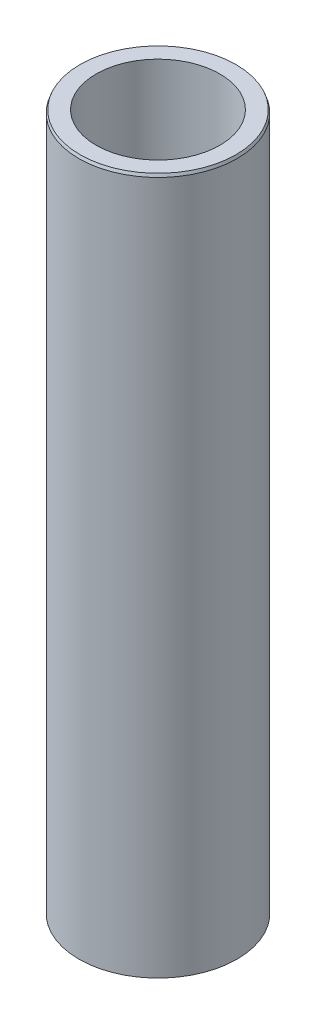
ISO-10303-21;
HEADER;
FILE_DESCRIPTION(('STEP AP214'),'2;1');
FILE_NAME('part.step','',(''),(''),'','','');
FILE_SCHEMA(('AUTOMOTIVE_DESIGN { 1 0 10303 214 1 1 1 1 }'));
ENDSEC;
DATA;
#1=APPLICATION_CONTEXT('core data for automotive mechanical design processes');
#2=APPLICATION_PROTOCOL_DEFINITION('international standard','automotive_design',2000,#1);
#3=PRODUCT_CONTEXT('',#1,'mechanical');
#4=PRODUCT('Part','Part','',(#3));
#5=PRODUCT_RELATED_PRODUCT_CATEGORY('part','',(#4));
#6=PRODUCT_DEFINITION_FORMATION('','',#4);
#7=PRODUCT_DEFINITION_CONTEXT('part definition',#1,'design');
#8=PRODUCT_DEFINITION('design','',#6,#7);
#9=PRODUCT_DEFINITION_SHAPE('','',#8);
#10=(LENGTH_UNIT() NAMED_UNIT(*) SI_UNIT(.MILLI.,.METRE.));
#11=(NAMED_UNIT(*) PLANE_ANGLE_UNIT() SI_UNIT($,.RADIAN.));
#12=(NAMED_UNIT(*) SI_UNIT($,.STERADIAN.) SOLID_ANGLE_UNIT());
#13=UNCERTAINTY_MEASURE_WITH_UNIT(LENGTH_MEASURE(1.E-05),#10,'distance_accuracy_value','');
#14=(GEOMETRIC_REPRESENTATION_CONTEXT(3) GLOBAL_UNCERTAINTY_ASSIGNED_CONTEXT((#13)) GLOBAL_UNIT_ASSIGNED_CONTEXT((#10,
#11,#12)) REPRESENTATION_CONTEXT('',''));
#15=CARTESIAN_POINT('',(0.,0.,0.));
#16=DIRECTION('',(0.,0.,1.));
#17=DIRECTION('',(1.,0.,0.));
#18=AXIS2_PLACEMENT_3D('',#15,#16,#17);
#19=CARTESIAN_POINT('',(0.,484.785143679758,0.));
#20=DIRECTION('',(0.,-1.,0.));
#21=DIRECTION('',(0.,0.,-1.));
#22=AXIS2_PLACEMENT_3D('',#19,#20,#21);
#23=CYLINDRICAL_SURFACE('',#22,55.);
#24=CARTESIAN_POINT('',(0.,482.781976871787,0.));
#25=DIRECTION('',(0.,1.,0.));
#26=DIRECTION('',(0.,0.,1.));
#27=AXIS2_PLACEMENT_3D('',#24,#25,#26);
#28=CIRCLE('',#27,55.);
#29=CARTESIAN_POINT('',(0.,482.781976871787,55.));
#30=VERTEX_POINT('',#29);
#31=EDGE_CURVE('E50',#30,#30,#28,.F.);
#32=ORIENTED_EDGE('',*,*,#31,.T.);
#33=EDGE_LOOP('',(#32));
#34=FACE_BOUND('',#33,.T.);
#35=CARTESIAN_POINT('',(0.,0.741889905357618,0.));
#36=DIRECTION('',(0.,1.,0.));
#37=DIRECTION('',(0.,0.,1.));
#38=AXIS2_PLACEMENT_3D('',#35,#36,#37);
#39=CIRCLE('',#38,55.);
#40=CARTESIAN_POINT('',(0.,0.741889905357618,55.));
#41=VERTEX_POINT('',#40);
#42=EDGE_CURVE('E51',#41,#41,#39,.T.);
#43=ORIENTED_EDGE('',*,*,#42,.T.);
#44=EDGE_LOOP('',(#43));
#45=FACE_BOUND('',#44,.T.);
#46=ADVANCED_FACE('F39',(#34,#45),#23,.T.);
#47=CARTESIAN_POINT('',(0.,484.785143679758,0.));
#48=DIRECTION('',(0.,1.,0.));
#49=DIRECTION('',(0.,0.,1.));
#50=AXIS2_PLACEMENT_3D('',#47,#48,#49);
#51=PLANE('',#50);
#52=CARTESIAN_POINT('',(0.,484.785143679758,0.));
#53=DIRECTION('',(0.,1.,0.));
#54=DIRECTION('',(0.,0.,1.));
#55=AXIS2_PLACEMENT_3D('',#52,#53,#54);
#56=CIRCLE('',#55,54.2581100946424);
#57=CARTESIAN_POINT('',(0.,484.785143679758,54.2581100946424));
#58=VERTEX_POINT('',#57);
#59=EDGE_CURVE('E54',#58,#58,#56,.T.);
#60=ORIENTED_EDGE('',*,*,#59,.T.);
#61=EDGE_LOOP('',(#60));
#62=FACE_BOUND('',#61,.T.);
#63=CARTESIAN_POINT('',(0.,484.785143679758,0.));
#64=DIRECTION('',(0.,1.,0.));
#65=DIRECTION('',(0.,0.,1.));
#66=AXIS2_PLACEMENT_3D('',#63,#64,#65);
#67=CIRCLE('',#66,43.0017311239381);
#68=CARTESIAN_POINT('',(0.,484.785143679758,43.0017311239381));
#69=VERTEX_POINT('',#68);
#70=EDGE_CURVE('E58',#69,#69,#67,.T.);
#71=ORIENTED_EDGE('',*,*,#70,.F.);
#72=EDGE_LOOP('',(#71));
#73=FACE_BOUND('',#72,.T.);
#74=ADVANCED_FACE('F69',(#62,#73),#51,.T.);
#75=CARTESIAN_POINT('',(0.,0.,0.));
#76=DIRECTION('',(0.,1.,0.));
#77=DIRECTION('',(0.,0.,1.));
#78=AXIS2_PLACEMENT_3D('',#75,#76,#77);
#79=PLANE('',#78);
#80=CARTESIAN_POINT('',(0.,0.,0.));
#81=DIRECTION('',(0.,1.,0.));
#82=DIRECTION('',(0.,0.,1.));
#83=AXIS2_PLACEMENT_3D('',#80,#81,#82);
#84=CIRCLE('',#83,52.9968331920279);
#85=CARTESIAN_POINT('',(0.,0.,52.9968331920279));
#86=VERTEX_POINT('',#85);
#87=EDGE_CURVE('E10',#86,#86,#84,.F.);
#88=ORIENTED_EDGE('',*,*,#87,.T.);
#89=EDGE_LOOP('',(#88));
#90=FACE_BOUND('',#89,.T.);
#91=CARTESIAN_POINT('',(0.,0.,0.));
#92=DIRECTION('',(0.,1.,0.));
#93=DIRECTION('',(0.,0.,1.));
#94=AXIS2_PLACEMENT_3D('',#91,#92,#93);
#95=CIRCLE('',#94,43.0017311239381);
#96=CARTESIAN_POINT('',(0.,0.,43.0017311239381));
#97=VERTEX_POINT('',#96);
#98=EDGE_CURVE('E63',#97,#97,#95,.T.);
#99=ORIENTED_EDGE('',*,*,#98,.T.);
#100=EDGE_LOOP('',(#99));
#101=FACE_BOUND('',#100,.T.);
#102=ADVANCED_FACE('F75',(#90,#101),#79,.F.);
#103=CARTESIAN_POINT('',(0.,484.785143679758,0.));
#104=DIRECTION('',(0.,-1.,0.));
#105=DIRECTION('',(0.,0.,-1.));
#106=AXIS2_PLACEMENT_3D('',#103,#104,#105);
#107=CYLINDRICAL_SURFACE('',#106,43.0017311239381);
#108=ORIENTED_EDGE('',*,*,#70,.T.);
#109=EDGE_LOOP('',(#108));
#110=FACE_BOUND('',#109,.T.);
#111=ORIENTED_EDGE('',*,*,#98,.F.);
#112=EDGE_LOOP('',(#111));
#113=FACE_BOUND('',#112,.T.);
#114=ADVANCED_FACE('F70',(#110,#113),#107,.F.);
#115=CARTESIAN_POINT('',(0.,484.785143679758,0.));
#116=DIRECTION('',(0.,-1.,0.));
#117=DIRECTION('',(0.,0.,-1.));
#118=AXIS2_PLACEMENT_3D('',#115,#116,#117);
#119=CONICAL_SURFACE('',#118,54.2581100946424,0.354695235926348);
#120=ORIENTED_EDGE('',*,*,#31,.F.);
#121=EDGE_LOOP('',(#120));
#122=FACE_BOUND('',#121,.T.);
#123=ORIENTED_EDGE('',*,*,#59,.F.);
#124=EDGE_LOOP('',(#123));
#125=FACE_BOUND('',#124,.T.);
#126=ADVANCED_FACE('F81',(#122,#125),#119,.T.);
#127=CARTESIAN_POINT('',(0.,0.741889905357618,0.));
#128=DIRECTION('',(0.,1.,0.));
#129=DIRECTION('',(0.,0.,1.));
#130=AXIS2_PLACEMENT_3D('',#127,#128,#129);
#131=CONICAL_SURFACE('',#130,55.,1.21610109086859);
#132=ORIENTED_EDGE('',*,*,#87,.F.);
#133=EDGE_LOOP('',(#132));
#134=FACE_BOUND('',#133,.T.);
#135=ORIENTED_EDGE('',*,*,#42,.F.);
#136=EDGE_LOOP('',(#135));
#137=FACE_BOUND('',#136,.T.);
#138=ADVANCED_FACE('F45',(#134,#137),#131,.T.);
#139=CLOSED_SHELL('',(#46,#74,#102,#114,#126,#138));
#140=MANIFOLD_SOLID_BREP('B2',#139);
#141=ADVANCED_BREP_SHAPE_REPRESENTATION('',(#18,#140),#14);
#142=SHAPE_DEFINITION_REPRESENTATION(#9,#141);
ENDSEC;
END-ISO-10303-21;
